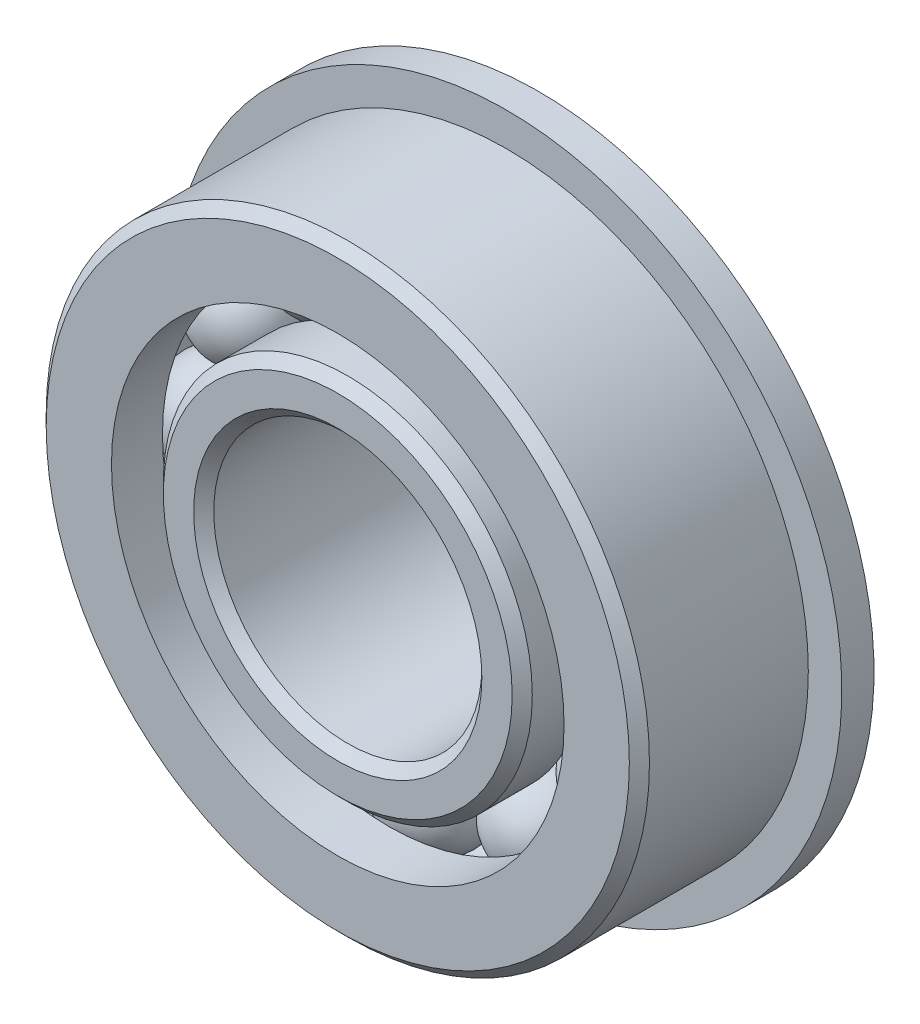
ISO-10303-21;
HEADER;
FILE_DESCRIPTION(('STEP AP214'),'2;1');
FILE_NAME('part.step','',(''),(''),'','','');
FILE_SCHEMA(('AUTOMOTIVE_DESIGN { 1 0 10303 214 1 1 1 1 }'));
ENDSEC;
DATA;
#1=APPLICATION_CONTEXT('core data for automotive mechanical design processes');
#2=APPLICATION_PROTOCOL_DEFINITION('international standard','automotive_design',2000,#1);
#3=PRODUCT_CONTEXT('',#1,'mechanical');
#4=PRODUCT('Part','Part','',(#3));
#5=PRODUCT_RELATED_PRODUCT_CATEGORY('part','',(#4));
#6=PRODUCT_DEFINITION_FORMATION('','',#4);
#7=PRODUCT_DEFINITION_CONTEXT('part definition',#1,'design');
#8=PRODUCT_DEFINITION('design','',#6,#7);
#9=PRODUCT_DEFINITION_SHAPE('','',#8);
#10=(LENGTH_UNIT() NAMED_UNIT(*) SI_UNIT(.MILLI.,.METRE.));
#11=(NAMED_UNIT(*) PLANE_ANGLE_UNIT() SI_UNIT($,.RADIAN.));
#12=(NAMED_UNIT(*) SI_UNIT($,.STERADIAN.) SOLID_ANGLE_UNIT());
#13=UNCERTAINTY_MEASURE_WITH_UNIT(LENGTH_MEASURE(1.E-05),#10,'distance_accuracy_value','');
#14=(GEOMETRIC_REPRESENTATION_CONTEXT(3) GLOBAL_UNCERTAINTY_ASSIGNED_CONTEXT((#13)) GLOBAL_UNIT_ASSIGNED_CONTEXT((#10,
#11,#12)) REPRESENTATION_CONTEXT('',''));
#15=CARTESIAN_POINT('',(0.,0.,0.));
#16=DIRECTION('',(0.,0.,1.));
#17=DIRECTION('',(1.,0.,0.));
#18=AXIS2_PLACEMENT_3D('',#15,#16,#17);
#19=CARTESIAN_POINT('',(-5.15937499999988,8.93629963530074,0.));
#20=DIRECTION('',(0.,0.,1.));
#21=DIRECTION('',(-0.499999999999989,0.866025403784445,0.));
#22=AXIS2_PLACEMENT_3D('',#19,#20,#21);
#23=SPHERICAL_SURFACE('',#22,2.38125);
#24=CARTESIAN_POINT('',(-5.15937499999988,8.93629963530074,2.38125000000001));
#25=VERTEX_POINT('',#24);
#26=VERTEX_LOOP('',#25);
#27=FACE_BOUND('',#26,.T.);
#28=ADVANCED_FACE('F41',(#27),#23,.T.);
#29=CLOSED_SHELL('',(#28));
#30=MANIFOLD_SOLID_BREP('B2',#29);
#31=CARTESIAN_POINT('',(-8.93629963530061,5.1593750000001,0.));
#32=DIRECTION('',(0.,0.,1.));
#33=DIRECTION('',(-0.866025403784433,0.50000000000001,0.));
#34=AXIS2_PLACEMENT_3D('',#31,#32,#33);
#35=SPHERICAL_SURFACE('',#34,2.38125);
#36=CARTESIAN_POINT('',(-8.93629963530061,5.1593750000001,2.38125000000001));
#37=VERTEX_POINT('',#36);
#38=VERTEX_LOOP('',#37);
#39=FACE_BOUND('',#38,.T.);
#40=ADVANCED_FACE('F61',(#39),#35,.T.);
#41=CLOSED_SHELL('',(#40));
#42=MANIFOLD_SOLID_BREP('B6',#41);
#43=CARTESIAN_POINT('',(-10.31875,1.08083169195563E-13,0.));
#44=DIRECTION('',(0.,0.,1.));
#45=DIRECTION('',(-1.,0.,0.));
#46=AXIS2_PLACEMENT_3D('',#43,#44,#45);
#47=SPHERICAL_SURFACE('',#46,2.38125);
#48=CARTESIAN_POINT('',(-10.31875,1.08083169195563E-13,2.38125000000001));
#49=VERTEX_POINT('',#48);
#50=VERTEX_LOOP('',#49);
#51=FACE_BOUND('',#50,.T.);
#52=ADVANCED_FACE('F81',(#51),#47,.T.);
#53=CLOSED_SHELL('',(#52));
#54=MANIFOLD_SOLID_BREP('B37',#53);
#55=CARTESIAN_POINT('',(-8.93629963530072,-5.15937499999992,0.));
#56=DIRECTION('',(0.,0.,1.));
#57=DIRECTION('',(-0.866025403784443,-0.499999999999992,0.));
#58=AXIS2_PLACEMENT_3D('',#55,#56,#57);
#59=SPHERICAL_SURFACE('',#58,2.38125);
#60=CARTESIAN_POINT('',(-8.93629963530072,-5.15937499999992,2.38125000000001));
#61=VERTEX_POINT('',#60);
#62=VERTEX_LOOP('',#61);
#63=FACE_BOUND('',#62,.T.);
#64=ADVANCED_FACE('F101',(#63),#59,.T.);
#65=CLOSED_SHELL('',(#64));
#66=MANIFOLD_SOLID_BREP('B57',#65);
#67=CARTESIAN_POINT('',(-5.15937500000007,-8.93629963530063,0.));
#68=DIRECTION('',(0.,0.,1.));
#69=DIRECTION('',(-0.500000000000007,-0.866025403784435,0.));
#70=AXIS2_PLACEMENT_3D('',#67,#68,#69);
#71=SPHERICAL_SURFACE('',#70,2.38125);
#72=CARTESIAN_POINT('',(-5.15937500000007,-8.93629963530063,2.38125000000001));
#73=VERTEX_POINT('',#72);
#74=VERTEX_LOOP('',#73);
#75=FACE_BOUND('',#74,.T.);
#76=ADVANCED_FACE('F124',(#75),#71,.T.);
#77=CLOSED_SHELL('',(#76));
#78=MANIFOLD_SOLID_BREP('B77',#77);
#79=CARTESIAN_POINT('',(0.,-10.31875,0.));
#80=DIRECTION('',(0.,0.,1.));
#81=DIRECTION('',(0.,-1.,0.));
#82=AXIS2_PLACEMENT_3D('',#79,#80,#81);
#83=SPHERICAL_SURFACE('',#82,2.38125);
#84=CARTESIAN_POINT('',(0.,-10.31875,2.38125000000001));
#85=VERTEX_POINT('',#84);
#86=VERTEX_LOOP('',#85);
#87=FACE_BOUND('',#86,.T.);
#88=ADVANCED_FACE('F147',(#87),#83,.T.);
#89=CLOSED_SHELL('',(#88));
#90=MANIFOLD_SOLID_BREP('B97',#89);
#91=CARTESIAN_POINT('',(5.15937499999995,-8.9362996353007,0.));
#92=DIRECTION('',(0.,0.,1.));
#93=DIRECTION('',(0.499999999999995,-0.866025403784442,0.));
#94=AXIS2_PLACEMENT_3D('',#91,#92,#93);
#95=SPHERICAL_SURFACE('',#94,2.38125);
#96=CARTESIAN_POINT('',(5.15937499999995,-8.9362996353007,2.38125000000001));
#97=VERTEX_POINT('',#96);
#98=VERTEX_LOOP('',#97);
#99=FACE_BOUND('',#98,.T.);
#100=ADVANCED_FACE('F167',(#99),#95,.T.);
#101=CLOSED_SHELL('',(#100));
#102=MANIFOLD_SOLID_BREP('B120',#101);
#103=CARTESIAN_POINT('',(8.93629963530065,-5.15937500000004,0.));
#104=DIRECTION('',(0.,0.,1.));
#105=DIRECTION('',(0.866025403784436,-0.500000000000004,0.));
#106=AXIS2_PLACEMENT_3D('',#103,#104,#105);
#107=SPHERICAL_SURFACE('',#106,2.38125);
#108=CARTESIAN_POINT('',(8.93629963530065,-5.15937500000004,2.38125000000001));
#109=VERTEX_POINT('',#108);
#110=VERTEX_LOOP('',#109);
#111=FACE_BOUND('',#110,.T.);
#112=ADVANCED_FACE('F187',(#111),#107,.T.);
#113=CLOSED_SHELL('',(#112));
#114=MANIFOLD_SOLID_BREP('B143',#113);
#115=CARTESIAN_POINT('',(10.31875,0.,0.));
#116=DIRECTION('',(0.,0.,1.));
#117=DIRECTION('',(1.,0.,0.));
#118=AXIS2_PLACEMENT_3D('',#115,#116,#117);
#119=SPHERICAL_SURFACE('',#118,2.38125);
#120=CARTESIAN_POINT('',(10.31875,0.,2.38125000000001));
#121=VERTEX_POINT('',#120);
#122=VERTEX_LOOP('',#121);
#123=FACE_BOUND('',#122,.T.);
#124=ADVANCED_FACE('F207',(#123),#119,.T.);
#125=CLOSED_SHELL('',(#124));
#126=MANIFOLD_SOLID_BREP('B163',#125);
#127=CARTESIAN_POINT('',(8.93629963530069,5.15937499999998,0.));
#128=DIRECTION('',(0.,0.,1.));
#129=DIRECTION('',(0.86602540378444,0.499999999999998,0.));
#130=AXIS2_PLACEMENT_3D('',#127,#128,#129);
#131=SPHERICAL_SURFACE('',#130,2.38125);
#132=CARTESIAN_POINT('',(8.93629963530069,5.15937499999998,2.38125000000001));
#133=VERTEX_POINT('',#132);
#134=VERTEX_LOOP('',#133);
#135=FACE_BOUND('',#134,.T.);
#136=ADVANCED_FACE('F227',(#135),#131,.T.);
#137=CLOSED_SHELL('',(#136));
#138=MANIFOLD_SOLID_BREP('B183',#137);
#139=CARTESIAN_POINT('',(5.15937500000001,8.93629963530067,0.));
#140=DIRECTION('',(0.,0.,1.));
#141=DIRECTION('',(0.500000000000001,0.866025403784438,0.));
#142=AXIS2_PLACEMENT_3D('',#139,#140,#141);
#143=SPHERICAL_SURFACE('',#142,2.38125);
#144=CARTESIAN_POINT('',(5.15937500000001,8.93629963530067,2.38125000000001));
#145=VERTEX_POINT('',#144);
#146=VERTEX_LOOP('',#145);
#147=FACE_BOUND('',#146,.T.);
#148=ADVANCED_FACE('F247',(#147),#143,.T.);
#149=CLOSED_SHELL('',(#148));
#150=MANIFOLD_SOLID_BREP('B203',#149);
#151=CARTESIAN_POINT('',(0.,10.31875,0.));
#152=DIRECTION('',(0.,0.,1.));
#153=DIRECTION('',(0.,1.,0.));
#154=AXIS2_PLACEMENT_3D('',#151,#152,#153);
#155=SPHERICAL_SURFACE('',#154,2.38125);
#156=CARTESIAN_POINT('',(0.,10.31875,2.38125000000001));
#157=VERTEX_POINT('',#156);
#158=VERTEX_LOOP('',#157);
#159=FACE_BOUND('',#158,.T.);
#160=ADVANCED_FACE('F269',(#159),#155,.T.);
#161=CLOSED_SHELL('',(#160));
#162=MANIFOLD_SOLID_BREP('B223',#161);
#163=CARTESIAN_POINT('',(0.,0.,4.28625));
#164=DIRECTION('',(0.,0.,-1.));
#165=DIRECTION('',(-1.,0.,0.));
#166=AXIS2_PLACEMENT_3D('',#163,#164,#165);
#167=CONICAL_SURFACE('',#166,8.7376,0.785398163397446);
#168=CARTESIAN_POINT('',(0.,0.,4.7625));
#169=DIRECTION('',(0.,0.,1.));
#170=DIRECTION('',(1.,0.,0.));
#171=AXIS2_PLACEMENT_3D('',#168,#169,#170);
#172=CIRCLE('',#171,8.26135);
#173=CARTESIAN_POINT('',(8.26135,0.,4.7625));
#174=VERTEX_POINT('',#173);
#175=EDGE_CURVE('E268',#174,#174,#172,.T.);
#176=ORIENTED_EDGE('',*,*,#175,.F.);
#177=EDGE_LOOP('',(#176));
#178=FACE_BOUND('',#177,.T.);
#179=CARTESIAN_POINT('',(0.,0.,4.28625));
#180=DIRECTION('',(0.,0.,1.));
#181=DIRECTION('',(1.,0.,0.));
#182=AXIS2_PLACEMENT_3D('',#179,#180,#181);
#183=CIRCLE('',#182,8.7376);
#184=CARTESIAN_POINT('',(8.7376,0.,4.28625));
#185=VERTEX_POINT('',#184);
#186=EDGE_CURVE('E325',#185,#185,#183,.T.);
#187=ORIENTED_EDGE('',*,*,#186,.T.);
#188=EDGE_LOOP('',(#187));
#189=FACE_BOUND('',#188,.T.);
#190=ADVANCED_FACE('F291',(#178,#189),#167,.T.);
#191=CARTESIAN_POINT('',(0.,6.82625,4.7625));
#192=DIRECTION('',(0.,0.,-1.));
#193=DIRECTION('',(-1.,0.,0.));
#194=AXIS2_PLACEMENT_3D('',#191,#192,#193);
#195=PLANE('',#194);
#196=CARTESIAN_POINT('',(0.,0.,4.7625));
#197=DIRECTION('',(0.,0.,1.));
#198=DIRECTION('',(1.,0.,0.));
#199=AXIS2_PLACEMENT_3D('',#196,#197,#198);
#200=CIRCLE('',#199,6.82625);
#201=CARTESIAN_POINT('',(6.82625,0.,4.7625));
#202=VERTEX_POINT('',#201);
#203=EDGE_CURVE('E297',#202,#202,#200,.T.);
#204=ORIENTED_EDGE('',*,*,#203,.F.);
#205=EDGE_LOOP('',(#204));
#206=FACE_BOUND('',#205,.T.);
#207=ORIENTED_EDGE('',*,*,#175,.T.);
#208=EDGE_LOOP('',(#207));
#209=FACE_BOUND('',#208,.T.);
#210=ADVANCED_FACE('F374',(#206,#209),#195,.F.);
#211=CARTESIAN_POINT('',(0.,0.,4.7625));
#212=DIRECTION('',(0.,0.,1.));
#213=DIRECTION('',(1.,0.,0.));
#214=AXIS2_PLACEMENT_3D('',#211,#212,#213);
#215=CONICAL_SURFACE('',#214,6.82625,0.785398163397449);
#216=CARTESIAN_POINT('',(0.,0.,4.28625));
#217=DIRECTION('',(0.,0.,1.));
#218=DIRECTION('',(1.,0.,0.));
#219=AXIS2_PLACEMENT_3D('',#216,#217,#218);
#220=CIRCLE('',#219,6.35);
#221=CARTESIAN_POINT('',(6.35,0.,4.28625));
#222=VERTEX_POINT('',#221);
#223=EDGE_CURVE('E301',#222,#222,#220,.T.);
#224=ORIENTED_EDGE('',*,*,#223,.F.);
#225=EDGE_LOOP('',(#224));
#226=FACE_BOUND('',#225,.T.);
#227=ORIENTED_EDGE('',*,*,#203,.T.);
#228=EDGE_LOOP('',(#227));
#229=FACE_BOUND('',#228,.T.);
#230=ADVANCED_FACE('F369',(#226,#229),#215,.F.);
#231=CARTESIAN_POINT('',(0.,0.,4.7625));
#232=DIRECTION('',(0.,0.,1.));
#233=DIRECTION('',(1.,0.,0.));
#234=AXIS2_PLACEMENT_3D('',#231,#232,#233);
#235=CYLINDRICAL_SURFACE('',#234,6.35);
#236=CARTESIAN_POINT('',(0.,0.,-5.88645));
#237=DIRECTION('',(0.,0.,1.));
#238=DIRECTION('',(1.,0.,0.));
#239=AXIS2_PLACEMENT_3D('',#236,#237,#238);
#240=CIRCLE('',#239,6.35);
#241=CARTESIAN_POINT('',(6.35,0.,-5.88645));
#242=VERTEX_POINT('',#241);
#243=EDGE_CURVE('E305',#242,#242,#240,.T.);
#244=ORIENTED_EDGE('',*,*,#243,.F.);
#245=EDGE_LOOP('',(#244));
#246=FACE_BOUND('',#245,.T.);
#247=ORIENTED_EDGE('',*,*,#223,.T.);
#248=EDGE_LOOP('',(#247));
#249=FACE_BOUND('',#248,.T.);
#250=ADVANCED_FACE('F363',(#246,#249),#235,.F.);
#251=CARTESIAN_POINT('',(0.,0.,-5.88645));
#252=DIRECTION('',(0.,0.,-1.));
#253=DIRECTION('',(-1.,0.,0.));
#254=AXIS2_PLACEMENT_3D('',#251,#252,#253);
#255=CONICAL_SURFACE('',#254,6.35,0.785398163397448);
#256=CARTESIAN_POINT('',(0.,0.,-6.3627));
#257=DIRECTION('',(0.,0.,1.));
#258=DIRECTION('',(1.,0.,0.));
#259=AXIS2_PLACEMENT_3D('',#256,#257,#258);
#260=CIRCLE('',#259,6.82625);
#261=CARTESIAN_POINT('',(6.82625,0.,-6.3627));
#262=VERTEX_POINT('',#261);
#263=EDGE_CURVE('E310',#262,#262,#260,.T.);
#264=ORIENTED_EDGE('',*,*,#263,.F.);
#265=EDGE_LOOP('',(#264));
#266=FACE_BOUND('',#265,.T.);
#267=ORIENTED_EDGE('',*,*,#243,.T.);
#268=EDGE_LOOP('',(#267));
#269=FACE_BOUND('',#268,.T.);
#270=ADVANCED_FACE('F357',(#266,#269),#255,.F.);
#271=CARTESIAN_POINT('',(0.,8.26135,-6.3627));
#272=DIRECTION('',(0.,0.,1.));
#273=DIRECTION('',(1.,0.,0.));
#274=AXIS2_PLACEMENT_3D('',#271,#272,#273);
#275=PLANE('',#274);
#276=CARTESIAN_POINT('',(0.,0.,-6.3627));
#277=DIRECTION('',(0.,0.,1.));
#278=DIRECTION('',(1.,0.,0.));
#279=AXIS2_PLACEMENT_3D('',#276,#277,#278);
#280=CIRCLE('',#279,8.26135);
#281=CARTESIAN_POINT('',(8.26135,0.,-6.3627));
#282=VERTEX_POINT('',#281);
#283=EDGE_CURVE('E313',#282,#282,#280,.T.);
#284=ORIENTED_EDGE('',*,*,#283,.F.);
#285=EDGE_LOOP('',(#284));
#286=FACE_BOUND('',#285,.T.);
#287=ORIENTED_EDGE('',*,*,#263,.T.);
#288=EDGE_LOOP('',(#287));
#289=FACE_BOUND('',#288,.T.);
#290=ADVANCED_FACE('F351',(#286,#289),#275,.F.);
#291=CARTESIAN_POINT('',(0.,0.,-6.3627));
#292=DIRECTION('',(0.,0.,1.));
#293=DIRECTION('',(1.,0.,0.));
#294=AXIS2_PLACEMENT_3D('',#291,#292,#293);
#295=CONICAL_SURFACE('',#294,8.26135,0.785398163397447);
#296=CARTESIAN_POINT('',(0.,0.,-5.88645));
#297=DIRECTION('',(0.,0.,1.));
#298=DIRECTION('',(1.,0.,0.));
#299=AXIS2_PLACEMENT_3D('',#296,#297,#298);
#300=CIRCLE('',#299,8.7376);
#301=CARTESIAN_POINT('',(8.7376,0.,-5.88645));
#302=VERTEX_POINT('',#301);
#303=EDGE_CURVE('E316',#302,#302,#300,.T.);
#304=ORIENTED_EDGE('',*,*,#303,.F.);
#305=EDGE_LOOP('',(#304));
#306=FACE_BOUND('',#305,.T.);
#307=ORIENTED_EDGE('',*,*,#283,.T.);
#308=EDGE_LOOP('',(#307));
#309=FACE_BOUND('',#308,.T.);
#310=ADVANCED_FACE('F345',(#306,#309),#295,.T.);
#311=CARTESIAN_POINT('',(0.,0.,4.7625));
#312=DIRECTION('',(0.,0.,1.));
#313=DIRECTION('',(1.,0.,0.));
#314=AXIS2_PLACEMENT_3D('',#311,#312,#313);
#315=CYLINDRICAL_SURFACE('',#314,8.7376);
#316=CARTESIAN_POINT('',(0.,0.,-1.78053818830151));
#317=DIRECTION('',(0.,0.,1.));
#318=DIRECTION('',(1.,0.,0.));
#319=AXIS2_PLACEMENT_3D('',#316,#317,#318);
#320=CIRCLE('',#319,8.7376);
#321=CARTESIAN_POINT('',(8.7376,0.,-1.78053818830151));
#322=VERTEX_POINT('',#321);
#323=EDGE_CURVE('E319',#322,#322,#320,.T.);
#324=ORIENTED_EDGE('',*,*,#323,.F.);
#325=EDGE_LOOP('',(#324));
#326=FACE_BOUND('',#325,.T.);
#327=ORIENTED_EDGE('',*,*,#303,.T.);
#328=EDGE_LOOP('',(#327));
#329=FACE_BOUND('',#328,.T.);
#330=ADVANCED_FACE('F339',(#326,#329),#315,.T.);
#331=CARTESIAN_POINT('',(0.,0.,0.));
#332=DIRECTION('',(0.,0.,1.));
#333=DIRECTION('',(1.,0.,0.));
#334=AXIS2_PLACEMENT_3D('',#331,#332,#333);
#335=TOROIDAL_SURFACE('',#334,10.31875,2.38125);
#336=CARTESIAN_POINT('',(0.,0.,1.78053818830151));
#337=DIRECTION('',(0.,0.,1.));
#338=DIRECTION('',(1.,0.,0.));
#339=AXIS2_PLACEMENT_3D('',#336,#337,#338);
#340=CIRCLE('',#339,8.7376);
#341=CARTESIAN_POINT('',(8.7376,0.,1.78053818830151));
#342=VERTEX_POINT('',#341);
#343=EDGE_CURVE('E322',#342,#342,#340,.T.);
#344=ORIENTED_EDGE('',*,*,#343,.F.);
#345=EDGE_LOOP('',(#344));
#346=FACE_BOUND('',#345,.T.);
#347=ORIENTED_EDGE('',*,*,#323,.T.);
#348=EDGE_LOOP('',(#347));
#349=FACE_BOUND('',#348,.T.);
#350=ADVANCED_FACE('F333',(#346,#349),#335,.F.);
#351=CARTESIAN_POINT('',(0.,0.,4.7625));
#352=DIRECTION('',(0.,0.,1.));
#353=DIRECTION('',(1.,0.,0.));
#354=AXIS2_PLACEMENT_3D('',#351,#352,#353);
#355=CYLINDRICAL_SURFACE('',#354,8.7376);
#356=ORIENTED_EDGE('',*,*,#186,.F.);
#357=EDGE_LOOP('',(#356));
#358=FACE_BOUND('',#357,.T.);
#359=ORIENTED_EDGE('',*,*,#343,.T.);
#360=EDGE_LOOP('',(#359));
#361=FACE_BOUND('',#360,.T.);
#362=ADVANCED_FACE('F330',(#358,#361),#355,.T.);
#363=CLOSED_SHELL('',(#190,#210,#230,#250,#270,#290,#310,#330,#350,#362));
#364=MANIFOLD_SOLID_BREP('B243',#363);
#365=CARTESIAN_POINT('',(0.,0.,4.28625));
#366=DIRECTION('',(0.,0.,-1.));
#367=DIRECTION('',(-1.,0.,0.));
#368=AXIS2_PLACEMENT_3D('',#365,#366,#367);
#369=CONICAL_SURFACE('',#368,14.2875,0.785398163397445);
#370=CARTESIAN_POINT('',(0.,0.,4.7625));
#371=DIRECTION('',(0.,0.,1.));
#372=DIRECTION('',(1.,0.,0.));
#373=AXIS2_PLACEMENT_3D('',#370,#371,#372);
#374=CIRCLE('',#373,13.81125);
#375=CARTESIAN_POINT('',(13.81125,0.,4.7625));
#376=VERTEX_POINT('',#375);
#377=EDGE_CURVE('E467',#376,#376,#374,.T.);
#378=ORIENTED_EDGE('',*,*,#377,.F.);
#379=EDGE_LOOP('',(#378));
#380=FACE_BOUND('',#379,.T.);
#381=CARTESIAN_POINT('',(0.,0.,4.28625));
#382=DIRECTION('',(0.,0.,1.));
#383=DIRECTION('',(1.,0.,0.));
#384=AXIS2_PLACEMENT_3D('',#381,#382,#383);
#385=CIRCLE('',#384,14.2875);
#386=CARTESIAN_POINT('',(14.2875,0.,4.28625));
#387=VERTEX_POINT('',#386);
#388=EDGE_CURVE('E290',#387,#387,#385,.T.);
#389=ORIENTED_EDGE('',*,*,#388,.T.);
#390=EDGE_LOOP('',(#389));
#391=FACE_BOUND('',#390,.T.);
#392=ADVANCED_FACE('F445',(#380,#391),#369,.T.);
#393=CARTESIAN_POINT('',(0.,0.,4.7625));
#394=DIRECTION('',(0.,0.,1.));
#395=DIRECTION('',(1.,0.,0.));
#396=AXIS2_PLACEMENT_3D('',#393,#394,#395);
#397=CYLINDRICAL_SURFACE('',#396,14.2875);
#398=CARTESIAN_POINT('',(0.,0.,-3.2385));
#399=DIRECTION('',(0.,0.,1.));
#400=DIRECTION('',(1.,0.,0.));
#401=AXIS2_PLACEMENT_3D('',#398,#399,#400);
#402=CIRCLE('',#401,14.2875);
#403=CARTESIAN_POINT('',(14.2875,0.,-3.2385));
#404=VERTEX_POINT('',#403);
#405=EDGE_CURVE('E470',#404,#404,#402,.T.);
#406=ORIENTED_EDGE('',*,*,#405,.T.);
#407=EDGE_LOOP('',(#406));
#408=FACE_BOUND('',#407,.T.);
#409=ORIENTED_EDGE('',*,*,#388,.F.);
#410=EDGE_LOOP('',(#409));
#411=FACE_BOUND('',#410,.T.);
#412=ADVANCED_FACE('F490',(#408,#411),#397,.T.);
#413=CARTESIAN_POINT('',(0.,13.81125,-4.7625));
#414=DIRECTION('',(0.,0.,1.));
#415=DIRECTION('',(1.,0.,0.));
#416=AXIS2_PLACEMENT_3D('',#413,#414,#415);
#417=PLANE('',#416);
#418=CARTESIAN_POINT('',(0.,0.,-4.7625));
#419=DIRECTION('',(0.,0.,1.));
#420=DIRECTION('',(1.,0.,0.));
#421=AXIS2_PLACEMENT_3D('',#418,#419,#420);
#422=CIRCLE('',#421,10.7188);
#423=CARTESIAN_POINT('',(10.7188,0.,-4.7625));
#424=VERTEX_POINT('',#423);
#425=EDGE_CURVE('E451',#424,#424,#422,.T.);
#426=ORIENTED_EDGE('',*,*,#425,.T.);
#427=EDGE_LOOP('',(#426));
#428=FACE_BOUND('',#427,.T.);
#429=CARTESIAN_POINT('',(0.,0.,-4.7625));
#430=DIRECTION('',(0.,0.,-1.));
#431=DIRECTION('',(-1.,0.,0.));
#432=AXIS2_PLACEMENT_3D('',#429,#430,#431);
#433=CIRCLE('',#432,15.875);
#434=CARTESIAN_POINT('',(-15.875,0.,-4.7625));
#435=VERTEX_POINT('',#434);
#436=EDGE_CURVE('E473',#435,#435,#433,.T.);
#437=ORIENTED_EDGE('',*,*,#436,.T.);
#438=EDGE_LOOP('',(#437));
#439=FACE_BOUND('',#438,.T.);
#440=ADVANCED_FACE('F493',(#428,#439),#417,.F.);
#441=CARTESIAN_POINT('',(0.,0.,4.7625));
#442=DIRECTION('',(0.,0.,1.));
#443=DIRECTION('',(1.,0.,0.));
#444=AXIS2_PLACEMENT_3D('',#441,#442,#443);
#445=CYLINDRICAL_SURFACE('',#444,10.7188);
#446=CARTESIAN_POINT('',(0.,0.,-2.34740528243421));
#447=DIRECTION('',(0.,0.,1.));
#448=DIRECTION('',(1.,0.,0.));
#449=AXIS2_PLACEMENT_3D('',#446,#447,#448);
#450=CIRCLE('',#449,10.7188);
#451=CARTESIAN_POINT('',(10.7188,0.,-2.34740528243421));
#452=VERTEX_POINT('',#451);
#453=EDGE_CURVE('E455',#452,#452,#450,.T.);
#454=ORIENTED_EDGE('',*,*,#453,.T.);
#455=EDGE_LOOP('',(#454));
#456=FACE_BOUND('',#455,.T.);
#457=ORIENTED_EDGE('',*,*,#425,.F.);
#458=EDGE_LOOP('',(#457));
#459=FACE_BOUND('',#458,.T.);
#460=ADVANCED_FACE('F498',(#456,#459),#445,.F.);
#461=CARTESIAN_POINT('',(0.,0.,0.));
#462=DIRECTION('',(0.,0.,1.));
#463=DIRECTION('',(1.,0.,0.));
#464=AXIS2_PLACEMENT_3D('',#461,#462,#463);
#465=TOROIDAL_SURFACE('',#464,10.31875,2.38125);
#466=ORIENTED_EDGE('',*,*,#453,.F.);
#467=EDGE_LOOP('',(#466));
#468=FACE_BOUND('',#467,.T.);
#469=CARTESIAN_POINT('',(0.,0.,2.34740528243421));
#470=DIRECTION('',(0.,0.,1.));
#471=DIRECTION('',(1.,0.,0.));
#472=AXIS2_PLACEMENT_3D('',#469,#470,#471);
#473=CIRCLE('',#472,10.7188);
#474=CARTESIAN_POINT('',(10.7188,0.,2.34740528243421));
#475=VERTEX_POINT('',#474);
#476=EDGE_CURVE('E459',#475,#475,#473,.T.);
#477=ORIENTED_EDGE('',*,*,#476,.T.);
#478=EDGE_LOOP('',(#477));
#479=FACE_BOUND('',#478,.T.);
#480=ADVANCED_FACE('F504',(#468,#479),#465,.F.);
#481=CARTESIAN_POINT('',(0.,0.,4.7625));
#482=DIRECTION('',(0.,0.,1.));
#483=DIRECTION('',(1.,0.,0.));
#484=AXIS2_PLACEMENT_3D('',#481,#482,#483);
#485=CYLINDRICAL_SURFACE('',#484,10.7188);
#486=ORIENTED_EDGE('',*,*,#476,.F.);
#487=EDGE_LOOP('',(#486));
#488=FACE_BOUND('',#487,.T.);
#489=CARTESIAN_POINT('',(0.,0.,4.7625));
#490=DIRECTION('',(0.,0.,1.));
#491=DIRECTION('',(1.,0.,0.));
#492=AXIS2_PLACEMENT_3D('',#489,#490,#491);
#493=CIRCLE('',#492,10.7188);
#494=CARTESIAN_POINT('',(10.7188,0.,4.7625));
#495=VERTEX_POINT('',#494);
#496=EDGE_CURVE('E464',#495,#495,#493,.T.);
#497=ORIENTED_EDGE('',*,*,#496,.T.);
#498=EDGE_LOOP('',(#497));
#499=FACE_BOUND('',#498,.T.);
#500=ADVANCED_FACE('F508',(#488,#499),#485,.F.);
#501=CARTESIAN_POINT('',(0.,13.81125,4.7625));
#502=DIRECTION('',(0.,0.,-1.));
#503=DIRECTION('',(-1.,0.,0.));
#504=AXIS2_PLACEMENT_3D('',#501,#502,#503);
#505=PLANE('',#504);
#506=ORIENTED_EDGE('',*,*,#496,.F.);
#507=EDGE_LOOP('',(#506));
#508=FACE_BOUND('',#507,.T.);
#509=ORIENTED_EDGE('',*,*,#377,.T.);
#510=EDGE_LOOP('',(#509));
#511=FACE_BOUND('',#510,.T.);
#512=ADVANCED_FACE('F486',(#508,#511),#505,.F.);
#513=CARTESIAN_POINT('',(0.,10.7188,-3.2385));
#514=DIRECTION('',(0.,0.,1.));
#515=DIRECTION('',(1.,0.,0.));
#516=AXIS2_PLACEMENT_3D('',#513,#514,#515);
#517=PLANE('',#516);
#518=CARTESIAN_POINT('',(0.,0.,-3.2385));
#519=DIRECTION('',(0.,0.,-1.));
#520=DIRECTION('',(-1.,0.,0.));
#521=AXIS2_PLACEMENT_3D('',#518,#519,#520);
#522=CIRCLE('',#521,15.875);
#523=CARTESIAN_POINT('',(-15.875,0.,-3.2385));
#524=VERTEX_POINT('',#523);
#525=EDGE_CURVE('E476',#524,#524,#522,.T.);
#526=ORIENTED_EDGE('',*,*,#525,.F.);
#527=EDGE_LOOP('',(#526));
#528=FACE_BOUND('',#527,.T.);
#529=ORIENTED_EDGE('',*,*,#405,.F.);
#530=EDGE_LOOP('',(#529));
#531=FACE_BOUND('',#530,.T.);
#532=ADVANCED_FACE('F483',(#528,#531),#517,.T.);
#533=CARTESIAN_POINT('',(0.,0.,-4.7625));
#534=DIRECTION('',(0.,0.,-1.));
#535=DIRECTION('',(-1.,0.,0.));
#536=AXIS2_PLACEMENT_3D('',#533,#534,#535);
#537=CYLINDRICAL_SURFACE('',#536,15.875);
#538=ORIENTED_EDGE('',*,*,#525,.T.);
#539=EDGE_LOOP('',(#538));
#540=FACE_BOUND('',#539,.T.);
#541=ORIENTED_EDGE('',*,*,#436,.F.);
#542=EDGE_LOOP('',(#541));
#543=FACE_BOUND('',#542,.T.);
#544=ADVANCED_FACE('F480',(#540,#543),#537,.T.);
#545=CLOSED_SHELL('',(#392,#412,#440,#460,#480,#500,#512,#532,#544));
#546=MANIFOLD_SOLID_BREP('B263',#545);
#547=ADVANCED_BREP_SHAPE_REPRESENTATION('',(#18,#30,#42,#54,#66,#78,#90,#102,#114,#126,#138,
#150,#162,#364,#546),#14);
#548=SHAPE_DEFINITION_REPRESENTATION(#9,#547);
ENDSEC;
END-ISO-10303-21;
